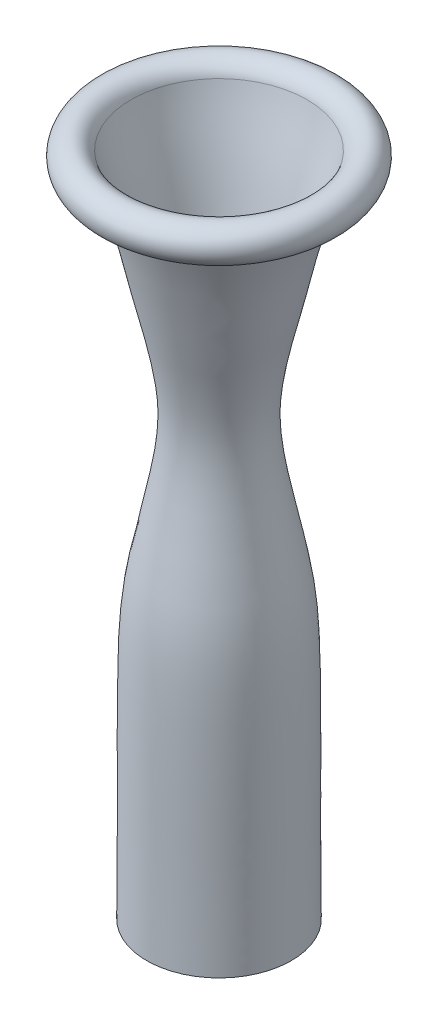
ISO-10303-21;
HEADER;
FILE_DESCRIPTION(('STEP AP214'),'2;1');
FILE_NAME('part.step','',(''),(''),'','','');
FILE_SCHEMA(('AUTOMOTIVE_DESIGN { 1 0 10303 214 1 1 1 1 }'));
ENDSEC;
DATA;
#1=APPLICATION_CONTEXT('core data for automotive mechanical design processes');
#2=APPLICATION_PROTOCOL_DEFINITION('international standard','automotive_design',2000,#1);
#3=PRODUCT_CONTEXT('',#1,'mechanical');
#4=PRODUCT('Part','Part','',(#3));
#5=PRODUCT_RELATED_PRODUCT_CATEGORY('part','',(#4));
#6=PRODUCT_DEFINITION_FORMATION('','',#4);
#7=PRODUCT_DEFINITION_CONTEXT('part definition',#1,'design');
#8=PRODUCT_DEFINITION('design','',#6,#7);
#9=PRODUCT_DEFINITION_SHAPE('','',#8);
#10=(LENGTH_UNIT() NAMED_UNIT(*) SI_UNIT(.MILLI.,.METRE.));
#11=(NAMED_UNIT(*) PLANE_ANGLE_UNIT() SI_UNIT($,.RADIAN.));
#12=(NAMED_UNIT(*) SI_UNIT($,.STERADIAN.) SOLID_ANGLE_UNIT());
#13=UNCERTAINTY_MEASURE_WITH_UNIT(LENGTH_MEASURE(1.E-05),#10,'distance_accuracy_value','');
#14=(GEOMETRIC_REPRESENTATION_CONTEXT(3) GLOBAL_UNCERTAINTY_ASSIGNED_CONTEXT((#13)) GLOBAL_UNIT_ASSIGNED_CONTEXT((#10,
#11,#12)) REPRESENTATION_CONTEXT('',''));
#15=CARTESIAN_POINT('',(0.,0.,0.));
#16=DIRECTION('',(0.,0.,1.));
#17=DIRECTION('',(1.,0.,0.));
#18=AXIS2_PLACEMENT_3D('',#15,#16,#17);
#19=CARTESIAN_POINT('',(36.7613237879422,-0.767406210440297,0.));
#20=CARTESIAN_POINT('',(36.7131320979086,6.74224821239774,0.));
#21=CARTESIAN_POINT('',(36.6076760662434,21.7642434312987,0.));
#22=CARTESIAN_POINT('',(36.5036162827326,44.2811160200189,0.));
#23=CARTESIAN_POINT('',(36.5665260245962,66.8075182975338,0.));
#24=CARTESIAN_POINT('',(36.5714954738407,89.3463329136561,0.));
#25=CARTESIAN_POINT('',(36.4044609051583,111.875328742924,0.));
#26=CARTESIAN_POINT('',(36.0324780619455,130.778358638283,0.));
#27=CARTESIAN_POINT('',(34.8561169087502,145.87721791094,0.));
#28=CARTESIAN_POINT('',(33.3176163116263,157.176324428717,0.));
#29=CARTESIAN_POINT('',(31.1226224325723,168.310452879459,0.));
#30=CARTESIAN_POINT('',(28.8121672485019,179.321210351794,0.));
#31=CARTESIAN_POINT('',(26.4841216398578,190.344775738851,0.));
#32=CARTESIAN_POINT('',(24.2518625258489,201.42013201451,0.));
#33=CARTESIAN_POINT('',(22.4598033111319,212.498603900951,0.));
#34=CARTESIAN_POINT('',(21.4180480748546,223.563539473796,0.));
#35=CARTESIAN_POINT('',(21.4883573460704,234.555683845101,0.));
#36=CARTESIAN_POINT('',(22.8081463349924,245.603491006735,0.));
#37=CARTESIAN_POINT('',(24.7809155566005,256.628156369155,0.));
#38=CARTESIAN_POINT('',(27.2300916354242,267.520785429771,0.));
#39=CARTESIAN_POINT('',(29.9655847477409,278.465305214759,0.));
#40=CARTESIAN_POINT('',(33.2945005390901,293.178805220896,0.));
#41=CARTESIAN_POINT('',(36.4838094731374,307.803060843823,0.));
#42=CARTESIAN_POINT('',(40.5254028253055,322.143444301047,0.));
#43=CARTESIAN_POINT('',(43.8948496763875,332.87388015414,0.));
#44=CARTESIAN_POINT('',(46.4128353234064,341.186323168752,0.));
#45=CARTESIAN_POINT('',(47.6715415447345,345.951007690039,0.));
#46=CARTESIAN_POINT('',(47.9505595580628,347.052796551552,0.));
#47=B_SPLINE_CURVE_WITH_KNOTS('',3,(#19,#20,#21,#22,#23,#24,#25,#26,#27,#28,#29,#30,#31,#32,#33,
#34,#35,#36,#37,#38,#39,#40,#41,#42,#43,#44,#45,#46),.UNSPECIFIED.,.F.,.F.,(4,1,1,1,1,1,1,1,1,1,
1,1,1,1,1,1,1,1,1,1,1,1,1,1,1,4),(-0.00217779424650493,0.0606960638291353,0.123569921904776,
0.186443779980416,0.249317638056056,0.312191496131696,0.375065354207336,0.406502283245157,
0.437939212282977,0.469376141320797,0.500813070358617,0.532249999396437,0.563686928434257,
0.595123857472077,0.626560786509897,0.657997715547718,0.689434644585538,0.720871573623358,
0.752308502661178,0.783745431698998,0.815182360736818,0.878056218812458,0.909493147850279,
0.940930076888099,0.972367005925919,0.981767927977716),.UNSPECIFIED.);
#48=CARTESIAN_POINT('',(0.,0.,0.));
#49=DIRECTION('',(0.,-1.,0.));
#50=AXIS1_PLACEMENT('',#48,#49);
#51=SURFACE_OF_REVOLUTION('',#47,#50);
#52=CARTESIAN_POINT('',(0.,0.,0.));
#53=DIRECTION('',(0.,-1.,0.));
#54=DIRECTION('',(0.,0.,-1.));
#55=AXIS2_PLACEMENT_3D('',#52,#53,#54);
#56=CIRCLE('',#55,36.7563838881858);
#57=CARTESIAN_POINT('',(0.,0.,-36.7563838881858));
#58=VERTEX_POINT('',#57);
#59=EDGE_CURVE('E181',#58,#58,#56,.T.);
#60=ORIENTED_EDGE('',*,*,#59,.T.);
#61=EDGE_LOOP('',(#60));
#62=FACE_BOUND('',#61,.T.);
#63=CARTESIAN_POINT('',(0.,347.052796551552,0.));
#64=DIRECTION('',(0.,-1.,0.));
#65=DIRECTION('',(0.,0.,-1.));
#66=AXIS2_PLACEMENT_3D('',#63,#64,#65);
#67=CIRCLE('',#66,47.9505595580628);
#68=CARTESIAN_POINT('',(0.,347.052796551552,-47.9505595580628));
#69=VERTEX_POINT('',#68);
#70=EDGE_CURVE('E178',#69,#69,#67,.T.);
#71=ORIENTED_EDGE('',*,*,#70,.F.);
#72=EDGE_LOOP('',(#71));
#73=FACE_BOUND('',#72,.T.);
#74=ADVANCED_FACE('F155',(#62,#73),#51,.T.);
#75=CARTESIAN_POINT('',(35.7565390054569,-2.53359745263795,0.));
#76=CARTESIAN_POINT('',(35.6635617496082,12.2194061905524,0.));
#77=CARTESIAN_POINT('',(35.480038727165,34.3489244101168,0.));
#78=CARTESIAN_POINT('',(35.5366419781064,63.8556270112126,0.));
#79=CARTESIAN_POINT('',(35.5703434115335,85.9893863247384,0.));
#80=CARTESIAN_POINT('',(35.4122500781798,108.112589762193,0.));
#81=CARTESIAN_POINT('',(35.1008639011526,130.335456680166,0.));
#82=CARTESIAN_POINT('',(33.675046646935,148.822068981716,0.));
#83=CARTESIAN_POINT('',(31.0893853925548,163.439967248981,0.));
#84=CARTESIAN_POINT('',(28.8338757541429,174.280322097851,0.));
#85=CARTESIAN_POINT('',(26.5545353354488,185.091125303233,0.));
#86=CARTESIAN_POINT('',(24.2844709609403,195.960536375567,0.));
#87=CARTESIAN_POINT('',(22.2655407290822,206.882996376716,0.));
#88=CARTESIAN_POINT('',(20.8318725613194,217.827773293167,0.));
#89=CARTESIAN_POINT('',(20.2701719650413,228.76554279813,0.));
#90=CARTESIAN_POINT('',(20.962162610771,239.688541102227,0.));
#91=CARTESIAN_POINT('',(22.6211923699948,250.614324982517,0.));
#92=CARTESIAN_POINT('',(24.7528346875911,261.423412668422,0.));
#93=CARTESIAN_POINT('',(27.3455533159772,272.149083545224,0.));
#94=CARTESIAN_POINT('',(30.8343764749891,286.524648574463,0.));
#95=CARTESIAN_POINT('',(33.8864502228113,300.969794637777,0.));
#96=CARTESIAN_POINT('',(37.4607739626012,315.225394731121,0.));
#97=CARTESIAN_POINT('',(40.5935707678095,325.805946903253,0.));
#98=CARTESIAN_POINT('',(43.8793911146067,336.217461246184,0.));
#99=CARTESIAN_POINT('',(45.9238510359752,343.245587114435,0.));
#100=CARTESIAN_POINT('',(46.8472010947242,346.838014586668,0.));
#101=CARTESIAN_POINT('',(46.8843367105238,346.983286754356,0.));
#102=CARTESIAN_POINT('',(46.9064703174938,347.070161108472,0.));
#103=B_SPLINE_CURVE_WITH_KNOTS('',3,(#75,#76,#77,#78,#79,#80,#81,#82,#83,#84,#85,#86,#87,#88,
#89,#90,#91,#92,#93,#94,#95,#96,#97,#98,#99,#100,#101,#102),.UNSPECIFIED.,.F.,.F.,(4,1,1,1,1,1,
1,1,1,1,1,1,1,1,1,1,1,1,1,1,1,1,1,1,1,4),(-0.00708767863805402,0.11643588749846,
0.178197670566718,0.239959453634975,0.301721236703232,0.363483019771489,0.425244802839746,
0.456125694373875,0.487006585908003,0.517887477442132,0.548768368976261,0.579649260510389,
0.610530152044518,0.641411043578646,0.672291935112775,0.703172826646904,0.734053718181032,
0.764934609715161,0.795815501249289,0.857577284317547,0.888458175851675,0.919339067385804,
0.950219958919932,0.979854634504369,0.980353120884246,0.981100850454061),.UNSPECIFIED.);
#104=CARTESIAN_POINT('',(0.,0.,0.));
#105=DIRECTION('',(0.,-1.,0.));
#106=AXIS1_PLACEMENT('',#104,#105);
#107=SURFACE_OF_REVOLUTION('',#103,#106);
#108=CARTESIAN_POINT('',(0.,0.,0.));
#109=DIRECTION('',(0.,-1.,0.));
#110=DIRECTION('',(0.,0.,-1.));
#111=AXIS2_PLACEMENT_3D('',#108,#109,#110);
#112=CIRCLE('',#111,35.7403072205011);
#113=CARTESIAN_POINT('',(0.,0.,-35.7403072205011));
#114=VERTEX_POINT('',#113);
#115=EDGE_CURVE('E159',#114,#114,#112,.T.);
#116=ORIENTED_EDGE('',*,*,#115,.F.);
#117=EDGE_LOOP('',(#116));
#118=FACE_BOUND('',#117,.T.);
#119=CARTESIAN_POINT('',(0.,346.728472178609,0.));
#120=DIRECTION('',(0.,-1.,0.));
#121=DIRECTION('',(0.,0.,-1.));
#122=AXIS2_PLACEMENT_3D('',#119,#120,#121);
#123=CIRCLE('',#122,46.8190375344728);
#124=CARTESIAN_POINT('',(0.,346.728472178609,-46.8190375344728));
#125=VERTEX_POINT('',#124);
#126=EDGE_CURVE('E167',#125,#125,#123,.T.);
#127=ORIENTED_EDGE('',*,*,#126,.T.);
#128=EDGE_LOOP('',(#127));
#129=FACE_BOUND('',#128,.T.);
#130=ADVANCED_FACE('F194',(#118,#129),#107,.F.);
#131=CARTESIAN_POINT('',(0.,344.907235,0.));
#132=DIRECTION('',(0.,-1.,0.));
#133=DIRECTION('',(0.,0.,-1.));
#134=AXIS2_PLACEMENT_3D('',#131,#132,#133);
#135=TOROIDAL_SURFACE('',#134,54.61,8.00099999999999);
#136=ORIENTED_EDGE('',*,*,#126,.F.);
#137=EDGE_LOOP('',(#136));
#138=FACE_BOUND('',#137,.T.);
#139=CARTESIAN_POINT('',(0.,341.320129210742,0.));
#140=DIRECTION('',(0.,-1.,0.));
#141=DIRECTION('',(0.,0.,-1.));
#142=AXIS2_PLACEMENT_3D('',#139,#140,#141);
#143=CIRCLE('',#142,47.4581699505179);
#144=CARTESIAN_POINT('',(0.,341.320129210742,-47.4581699505179));
#145=VERTEX_POINT('',#144);
#146=EDGE_CURVE('E172',#145,#145,#143,.T.);
#147=ORIENTED_EDGE('',*,*,#146,.T.);
#148=EDGE_LOOP('',(#147));
#149=FACE_BOUND('',#148,.T.);
#150=ADVANCED_FACE('F198',(#138,#149),#135,.F.);
#151=CARTESIAN_POINT('',(37.7740093872998,-0.248839860699674,0.));
#152=CARTESIAN_POINT('',(37.7257366955878,7.23952675693627,0.));
#153=CARTESIAN_POINT('',(37.620755881214,22.2201174483164,0.));
#154=CARTESIAN_POINT('',(37.5193820978681,44.6678939944613,0.));
#155=CARTESIAN_POINT('',(37.583849876972,67.1265247745048,0.));
#156=CARTESIAN_POINT('',(37.5859221036949,89.6124765408425,0.));
#157=CARTESIAN_POINT('',(37.4190255125957,112.07937851022,0.));
#158=CARTESIAN_POINT('',(37.0411142163314,130.96662272604,0.));
#159=CARTESIAN_POINT('',(35.8562895161916,146.084292580323,0.));
#160=CARTESIAN_POINT('',(34.3059842464853,157.42243069391,0.));
#161=CARTESIAN_POINT('',(32.1087490073907,168.557667046197,0.));
#162=CARTESIAN_POINT('',(29.8045200267421,179.539376951679,0.));
#163=CARTESIAN_POINT('',(27.483099834056,190.531700444512,0.));
#164=CARTESIAN_POINT('',(25.2611427529859,201.553894996035,0.));
#165=CARTESIAN_POINT('',(23.4793429210393,212.548183116297,0.));
#166=CARTESIAN_POINT('',(22.4416276933381,223.502828345667,0.));
#167=CARTESIAN_POINT('',(22.4953001587295,234.340831365392,0.));
#168=CARTESIAN_POINT('',(23.7852657910921,245.269466144952,0.));
#169=CARTESIAN_POINT('',(25.7372277155555,256.224437010643,0.));
#170=CARTESIAN_POINT('',(28.1591335816175,267.043202435783,0.));
#171=CARTESIAN_POINT('',(30.8879756055257,277.957963504745,0.));
#172=CARTESIAN_POINT('',(34.2230954401327,292.659748162302,0.));
#173=CARTESIAN_POINT('',(37.3909126048867,307.221151091198,0.));
#174=CARTESIAN_POINT('',(41.3827553401468,321.467970155071,0.));
#175=CARTESIAN_POINT('',(44.7325395609287,332.154670327106,0.));
#176=CARTESIAN_POINT('',(47.3067187807723,340.613943276313,0.));
#177=CARTESIAN_POINT('',(48.6161281170924,345.542290291704,0.));
#178=CARTESIAN_POINT('',(48.9354729986395,346.803389469596,0.));
#179=B_SPLINE_CURVE_WITH_KNOTS('',3,(#151,#152,#153,#154,#155,#156,#157,#158,#159,#160,#161,
#162,#163,#164,#165,#166,#167,#168,#169,#170,#171,#172,#173,#174,#175,#176,#177,#178),
.UNSPECIFIED.,.F.,.F.,(4,1,1,1,1,1,1,1,1,1,1,1,1,1,1,1,1,1,1,1,1,1,1,1,1,4),
(-0.000749203691920604,0.0619491490736327,0.124647501839186,0.187345854604739,0.250044207370293,
0.312742560135846,0.375440912901399,0.406790089284176,0.438139265666952,0.469488442049729,
0.500837618432506,0.532186794815282,0.563535971198059,0.594885147580835,0.626234323963612,
0.657583500346389,0.688932676729165,0.720281853111942,0.751631029494719,0.782980205877495,
0.814329382260272,0.877027735025825,0.908376911408602,0.939726087791379,0.971075264174155,
0.981768499795205),.UNSPECIFIED.);
#180=CARTESIAN_POINT('',(0.,0.,0.));
#181=DIRECTION('',(0.,-1.,0.));
#182=AXIS1_PLACEMENT('',#180,#181);
#183=SURFACE_OF_REVOLUTION('',#179,#182);
#184=CARTESIAN_POINT('',(0.,346.803389469596,0.));
#185=DIRECTION('',(0.,-1.,0.));
#186=DIRECTION('',(0.,0.,-1.));
#187=AXIS2_PLACEMENT_3D('',#184,#185,#186);
#188=CIRCLE('',#187,48.9354729986395);
#189=CARTESIAN_POINT('',(0.,346.803389469596,-48.9354729986395));
#190=VERTEX_POINT('',#189);
#191=EDGE_CURVE('E175',#190,#190,#188,.T.);
#192=ORIENTED_EDGE('',*,*,#191,.T.);
#193=EDGE_LOOP('',(#192));
#194=FACE_BOUND('',#193,.T.);
#195=ORIENTED_EDGE('',*,*,#146,.F.);
#196=EDGE_LOOP('',(#195));
#197=FACE_BOUND('',#196,.T.);
#198=ADVANCED_FACE('F214',(#194,#197),#183,.F.);
#199=CARTESIAN_POINT('',(0.,347.052796551552,0.));
#200=DIRECTION('',(0.,-1.,0.));
#201=DIRECTION('',(0.,0.,-1.));
#202=AXIS2_PLACEMENT_3D('',#199,#200,#201);
#203=CONICAL_SURFACE('',#202,47.9505595580628,1.32278241336407);
#204=ORIENTED_EDGE('',*,*,#191,.F.);
#205=EDGE_LOOP('',(#204));
#206=FACE_BOUND('',#205,.T.);
#207=ORIENTED_EDGE('',*,*,#70,.T.);
#208=EDGE_LOOP('',(#207));
#209=FACE_BOUND('',#208,.T.);
#210=ADVANCED_FACE('F225',(#206,#209),#203,.T.);
#211=CARTESIAN_POINT('',(76.2,0.,50.8));
#212=DIRECTION('',(0.,1.,0.));
#213=DIRECTION('',(-1.,0.,0.));
#214=AXIS2_PLACEMENT_3D('',#211,#212,#213);
#215=PLANE('',#214);
#216=ORIENTED_EDGE('',*,*,#115,.T.);
#217=EDGE_LOOP('',(#216));
#218=FACE_BOUND('',#217,.T.);
#219=CARTESIAN_POINT('',(0.,0.,0.));
#220=DIRECTION('',(0.,-1.,0.));
#221=DIRECTION('',(0.,0.,-1.));
#222=AXIS2_PLACEMENT_3D('',#219,#220,#221);
#223=CIRCLE('',#222,34.72434);
#224=CARTESIAN_POINT('',(0.,0.,-34.72434));
#225=VERTEX_POINT('',#224);
#226=EDGE_CURVE('E254',#225,#225,#223,.T.);
#227=ORIENTED_EDGE('',*,*,#226,.F.);
#228=EDGE_LOOP('',(#227));
#229=FACE_BOUND('',#228,.T.);
#230=ADVANCED_FACE('F212',(#218,#229),#215,.F.);
#231=CARTESIAN_POINT('',(0.,0.,0.));
#232=DIRECTION('',(0.,-1.,0.));
#233=DIRECTION('',(0.,0.,-1.));
#234=AXIS2_PLACEMENT_3D('',#231,#232,#233);
#235=CIRCLE('',#234,37.7724037469927);
#236=CARTESIAN_POINT('',(0.,0.,-37.7724037469927));
#237=VERTEX_POINT('',#236);
#238=EDGE_CURVE('E251',#237,#237,#235,.T.);
#239=ORIENTED_EDGE('',*,*,#238,.F.);
#240=EDGE_LOOP('',(#239));
#241=FACE_BOUND('',#240,.T.);
#242=CARTESIAN_POINT('',(0.,339.963416622729,0.));
#243=DIRECTION('',(0.,-1.,0.));
#244=DIRECTION('',(0.,0.,-1.));
#245=AXIS2_PLACEMENT_3D('',#242,#243,#244);
#246=CIRCLE('',#245,47.0691148495313);
#247=CARTESIAN_POINT('',(0.,339.963416622729,-47.0691148495313));
#248=VERTEX_POINT('',#247);
#249=EDGE_CURVE('E94',#248,#248,#246,.T.);
#250=ORIENTED_EDGE('',*,*,#249,.T.);
#251=EDGE_LOOP('',(#250));
#252=FACE_BOUND('',#251,.T.);
#253=ADVANCED_FACE('F207',(#241,#252),#183,.F.);
#254=CARTESIAN_POINT('',(0.,344.907235,0.));
#255=DIRECTION('',(0.,-1.,0.));
#256=DIRECTION('',(0.,0.,-1.));
#257=AXIS2_PLACEMENT_3D('',#254,#255,#256);
#258=TOROIDAL_SURFACE('',#257,54.61,9.017);
#259=CARTESIAN_POINT('',(0.,347.320965295155,0.));
#260=DIRECTION('',(0.,-1.,0.));
#261=DIRECTION('',(0.,0.,-1.));
#262=AXIS2_PLACEMENT_3D('',#259,#260,#261);
#263=CIRCLE('',#262,45.9220661223595);
#264=CARTESIAN_POINT('',(0.,347.320965295155,-45.9220661223595));
#265=VERTEX_POINT('',#264);
#266=EDGE_CURVE('E163',#265,#265,#263,.T.);
#267=ORIENTED_EDGE('',*,*,#266,.T.);
#268=EDGE_LOOP('',(#267));
#269=FACE_BOUND('',#268,.T.);
#270=ORIENTED_EDGE('',*,*,#249,.F.);
#271=EDGE_LOOP('',(#270));
#272=FACE_BOUND('',#271,.T.);
#273=ADVANCED_FACE('F204',(#269,#272),#258,.T.);
#274=CARTESIAN_POINT('',(34.7405591791871,-2.54,0.));
#275=CARTESIAN_POINT('',(34.7352235488052,-1.6933224946352,0.));
#276=CARTESIAN_POINT('',(34.6877138551828,5.73716494407831,0.));
#277=CARTESIAN_POINT('',(34.57342004559,22.1092420217789,0.));
#278=CARTESIAN_POINT('',(34.4536295482668,48.0316710295498,0.));
#279=CARTESIAN_POINT('',(34.5856958194276,78.1554695713546,0.));
#280=CARTESIAN_POINT('',(34.4019545762758,113.788178620435,0.));
#281=CARTESIAN_POINT('',(33.7579129264615,144.512575098664,0.));
#282=CARTESIAN_POINT('',(28.5838364406518,170.714811347288,0.));
#283=CARTESIAN_POINT('',(23.0693550792723,196.377518698096,0.));
#284=CARTESIAN_POINT('',(17.8519948973183,223.661322415157,0.));
#285=CARTESIAN_POINT('',(21.0831409709264,248.143840626669,0.));
#286=CARTESIAN_POINT('',(24.2809627513592,264.247188105725,0.));
#287=CARTESIAN_POINT('',(29.7755766884443,285.705093422189,0.));
#288=CARTESIAN_POINT('',(34.1118879611442,307.612396918127,0.));
#289=CARTESIAN_POINT('',(40.2552051433513,328.200691632403,0.));
#290=CARTESIAN_POINT('',(43.6592359514508,338.885861241598,0.));
#291=CARTESIAN_POINT('',(45.4858152189022,345.608684514354,0.));
#292=CARTESIAN_POINT('',(45.9220661223595,347.320965295155,0.));
#293=B_SPLINE_CURVE_WITH_KNOTS('',3,(#274,#275,#276,#277,#278,#279,#280,#281,#282,#283,#284,
#285,#286,#287,#288,#289,#290,#291,#292),.UNSPECIFIED.,.F.,.F.,(4,1,1,1,1,1,1,1,1,1,1,1,1,1,1,1,
4),(-0.00708767863805402,0.,0.0551149975619354,0.129981768494186,0.217028685407187,
0.307233714829983,0.428601166687978,0.473063774242941,0.530453701936126,0.6489875422939,
0.701889736529159,0.736021155153781,0.786493062912462,0.887251582522909,0.92275566736076,
0.966305565267647,0.981100850454061),.UNSPECIFIED.);
#294=CARTESIAN_POINT('',(0.,0.,0.));
#295=DIRECTION('',(0.,-1.,0.));
#296=AXIS1_PLACEMENT('',#294,#295);
#297=SURFACE_OF_REVOLUTION('',#293,#296);
#298=ORIENTED_EDGE('',*,*,#226,.T.);
#299=EDGE_LOOP('',(#298));
#300=FACE_BOUND('',#299,.T.);
#301=ORIENTED_EDGE('',*,*,#266,.F.);
#302=EDGE_LOOP('',(#301));
#303=FACE_BOUND('',#302,.T.);
#304=ADVANCED_FACE('F201',(#300,#303),#297,.T.);
#305=ORIENTED_EDGE('',*,*,#238,.T.);
#306=EDGE_LOOP('',(#305));
#307=FACE_BOUND('',#306,.T.);
#308=ORIENTED_EDGE('',*,*,#59,.F.);
#309=EDGE_LOOP('',(#308));
#310=FACE_BOUND('',#309,.T.);
#311=ADVANCED_FACE('F203',(#307,#310),#215,.F.);
#312=CLOSED_SHELL('',(#74,#130,#150,#198,#210,#230,#253,#273,#304,#311));
#313=MANIFOLD_SOLID_BREP('B47',#312);
#314=ADVANCED_BREP_SHAPE_REPRESENTATION('',(#18,#313),#14);
#315=SHAPE_DEFINITION_REPRESENTATION(#9,#314);
ENDSEC;
END-ISO-10303-21;
